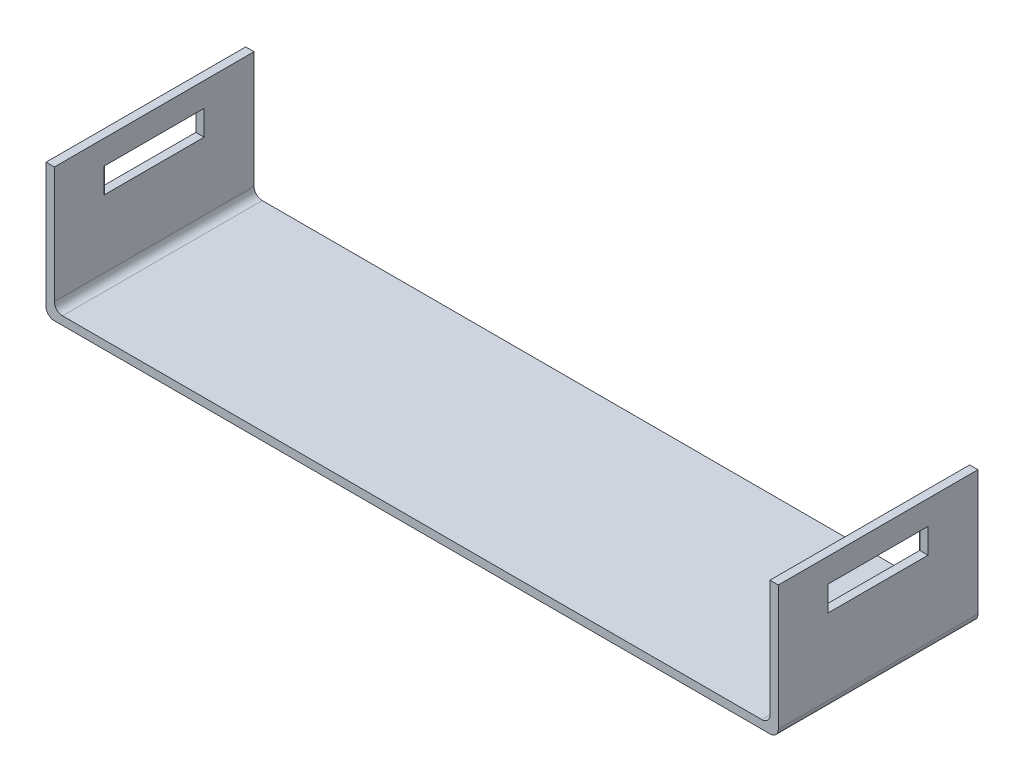
ISO-10303-21;
HEADER;
FILE_DESCRIPTION(('STEP AP214'),'2;1');
FILE_NAME('part.step','',(''),(''),'','','');
FILE_SCHEMA(('AUTOMOTIVE_DESIGN { 1 0 10303 214 1 1 1 1 }'));
ENDSEC;
DATA;
#1=APPLICATION_CONTEXT('core data for automotive mechanical design processes');
#2=APPLICATION_PROTOCOL_DEFINITION('international standard','automotive_design',2000,#1);
#3=PRODUCT_CONTEXT('',#1,'mechanical');
#4=PRODUCT('Part','Part','',(#3));
#5=PRODUCT_RELATED_PRODUCT_CATEGORY('part','',(#4));
#6=PRODUCT_DEFINITION_FORMATION('','',#4);
#7=PRODUCT_DEFINITION_CONTEXT('part definition',#1,'design');
#8=PRODUCT_DEFINITION('design','',#6,#7);
#9=PRODUCT_DEFINITION_SHAPE('','',#8);
#10=(LENGTH_UNIT() NAMED_UNIT(*) SI_UNIT(.MILLI.,.METRE.));
#11=(NAMED_UNIT(*) PLANE_ANGLE_UNIT() SI_UNIT($,.RADIAN.));
#12=(NAMED_UNIT(*) SI_UNIT($,.STERADIAN.) SOLID_ANGLE_UNIT());
#13=UNCERTAINTY_MEASURE_WITH_UNIT(LENGTH_MEASURE(1.E-05),#10,'distance_accuracy_value','');
#14=(GEOMETRIC_REPRESENTATION_CONTEXT(3) GLOBAL_UNCERTAINTY_ASSIGNED_CONTEXT((#13)) GLOBAL_UNIT_ASSIGNED_CONTEXT((#10,
#11,#12)) REPRESENTATION_CONTEXT('',''));
#15=CARTESIAN_POINT('',(0.,0.,0.));
#16=DIRECTION('',(0.,0.,1.));
#17=DIRECTION('',(1.,0.,0.));
#18=AXIS2_PLACEMENT_3D('',#15,#16,#17);
#19=CARTESIAN_POINT('',(-22.,7.5,12.));
#20=DIRECTION('',(0.,-1.,0.));
#21=DIRECTION('',(1.,0.,0.));
#22=AXIS2_PLACEMENT_3D('',#19,#20,#21);
#23=PLANE('',#22);
#24=DIRECTION('',(-1.,0.,0.));
#25=VECTOR('',#24,1.);
#26=CARTESIAN_POINT('',(-22.,7.5,0.));
#27=LINE('',#26,#25);
#28=CARTESIAN_POINT('',(-21.5,7.5,0.));
#29=VERTEX_POINT('',#28);
#30=CARTESIAN_POINT('',(-22.,7.5,0.));
#31=VERTEX_POINT('',#30);
#32=EDGE_CURVE('E228',#29,#31,#27,.T.);
#33=ORIENTED_EDGE('',*,*,#32,.T.);
#34=DIRECTION('',(0.,0.,-1.));
#35=VECTOR('',#34,1.);
#36=CARTESIAN_POINT('',(-22.,7.5,12.));
#37=LINE('',#36,#35);
#38=CARTESIAN_POINT('',(-22.,7.5,12.));
#39=VERTEX_POINT('',#38);
#40=EDGE_CURVE('E312',#39,#31,#37,.T.);
#41=ORIENTED_EDGE('',*,*,#40,.F.);
#42=DIRECTION('',(-1.,0.,0.));
#43=VECTOR('',#42,1.);
#44=CARTESIAN_POINT('',(-22.,7.5,12.));
#45=LINE('',#44,#43);
#46=CARTESIAN_POINT('',(-21.5,7.5,12.));
#47=VERTEX_POINT('',#46);
#48=EDGE_CURVE('E229',#47,#39,#45,.T.);
#49=ORIENTED_EDGE('',*,*,#48,.F.);
#50=DIRECTION('',(0.,0.,-1.));
#51=VECTOR('',#50,1.);
#52=CARTESIAN_POINT('',(-21.5,7.5,12.));
#53=LINE('',#52,#51);
#54=EDGE_CURVE('E255',#47,#29,#53,.T.);
#55=ORIENTED_EDGE('',*,*,#54,.T.);
#56=EDGE_LOOP('',(#33,#41,#49,#55));
#57=FACE_BOUND('',#56,.T.);
#58=ADVANCED_FACE('F35',(#57),#23,.F.);
#59=CARTESIAN_POINT('',(-22.,-0.0100000000000054,12.));
#60=DIRECTION('',(1.,0.,0.));
#61=DIRECTION('',(0.,0.,-1.));
#62=AXIS2_PLACEMENT_3D('',#59,#60,#61);
#63=PLANE('',#62);
#64=DIRECTION('',(0.,0.,-1.));
#65=VECTOR('',#64,1.);
#66=CARTESIAN_POINT('',(-22.,6.05,3.));
#67=LINE('',#66,#65);
#68=CARTESIAN_POINT('',(-22.,6.05,9.));
#69=VERTEX_POINT('',#68);
#70=CARTESIAN_POINT('',(-22.,6.05,3.));
#71=VERTEX_POINT('',#70);
#72=EDGE_CURVE('E206',#69,#71,#67,.T.);
#73=ORIENTED_EDGE('',*,*,#72,.F.);
#74=DIRECTION('',(0.,1.,0.));
#75=VECTOR('',#74,1.);
#76=CARTESIAN_POINT('',(-22.,6.05,9.));
#77=LINE('',#76,#75);
#78=CARTESIAN_POINT('',(-22.,4.55,9.));
#79=VERTEX_POINT('',#78);
#80=EDGE_CURVE('E49',#79,#69,#77,.T.);
#81=ORIENTED_EDGE('',*,*,#80,.F.);
#82=DIRECTION('',(0.,0.,1.));
#83=VECTOR('',#82,1.);
#84=CARTESIAN_POINT('',(-22.,4.55,3.));
#85=LINE('',#84,#83);
#86=CARTESIAN_POINT('',(-22.,4.55,3.));
#87=VERTEX_POINT('',#86);
#88=EDGE_CURVE('E197',#87,#79,#85,.T.);
#89=ORIENTED_EDGE('',*,*,#88,.F.);
#90=DIRECTION('',(0.,-1.,0.));
#91=VECTOR('',#90,1.);
#92=CARTESIAN_POINT('',(-22.,6.05,3.));
#93=LINE('',#92,#91);
#94=EDGE_CURVE('E200',#71,#87,#93,.T.);
#95=ORIENTED_EDGE('',*,*,#94,.F.);
#96=EDGE_LOOP('',(#73,#81,#89,#95));
#97=FACE_BOUND('',#96,.T.);
#98=DIRECTION('',(0.,-1.,0.));
#99=VECTOR('',#98,1.);
#100=CARTESIAN_POINT('',(-22.,-0.0100000000000054,0.));
#101=LINE('',#100,#99);
#102=CARTESIAN_POINT('',(-22.,-0.0100000000000054,0.));
#103=VERTEX_POINT('',#102);
#104=EDGE_CURVE('E258',#31,#103,#101,.T.);
#105=ORIENTED_EDGE('',*,*,#104,.T.);
#106=DIRECTION('',(0.,0.,-1.));
#107=VECTOR('',#106,1.);
#108=CARTESIAN_POINT('',(-22.,-0.0100000000000054,12.));
#109=LINE('',#108,#107);
#110=CARTESIAN_POINT('',(-22.,-0.0100000000000054,12.));
#111=VERTEX_POINT('',#110);
#112=EDGE_CURVE('E309',#111,#103,#109,.T.);
#113=ORIENTED_EDGE('',*,*,#112,.F.);
#114=DIRECTION('',(0.,-1.,0.));
#115=VECTOR('',#114,1.);
#116=CARTESIAN_POINT('',(-22.,-0.0100000000000054,12.));
#117=LINE('',#116,#115);
#118=EDGE_CURVE('E232',#39,#111,#117,.T.);
#119=ORIENTED_EDGE('',*,*,#118,.F.);
#120=ORIENTED_EDGE('',*,*,#40,.T.);
#121=EDGE_LOOP('',(#105,#113,#119,#120));
#122=FACE_BOUND('',#121,.T.);
#123=ADVANCED_FACE('F335',(#97,#122),#63,.F.);
#124=CARTESIAN_POINT('',(-21.51,-0.0100000000000054,12.));
#125=DIRECTION('',(0.,0.,-1.));
#126=DIRECTION('',(-1.,0.,0.));
#127=AXIS2_PLACEMENT_3D('',#124,#125,#126);
#128=CYLINDRICAL_SURFACE('',#127,0.49);
#129=CARTESIAN_POINT('',(-21.51,-0.0100000000000054,0.));
#130=DIRECTION('',(0.,0.,1.));
#131=DIRECTION('',(-1.,0.,0.));
#132=AXIS2_PLACEMENT_3D('',#129,#130,#131);
#133=CIRCLE('',#132,0.49);
#134=CARTESIAN_POINT('',(-21.51,-0.500000000000006,0.));
#135=VERTEX_POINT('',#134);
#136=EDGE_CURVE('E260',#103,#135,#133,.T.);
#137=ORIENTED_EDGE('',*,*,#136,.T.);
#138=DIRECTION('',(0.,0.,-1.));
#139=VECTOR('',#138,1.);
#140=CARTESIAN_POINT('',(-21.51,-0.500000000000006,12.));
#141=LINE('',#140,#139);
#142=CARTESIAN_POINT('',(-21.51,-0.500000000000006,12.));
#143=VERTEX_POINT('',#142);
#144=EDGE_CURVE('E306',#143,#135,#141,.T.);
#145=ORIENTED_EDGE('',*,*,#144,.F.);
#146=CARTESIAN_POINT('',(-21.51,-0.0100000000000054,12.));
#147=DIRECTION('',(0.,0.,1.));
#148=DIRECTION('',(-1.,0.,0.));
#149=AXIS2_PLACEMENT_3D('',#146,#147,#148);
#150=CIRCLE('',#149,0.49);
#151=EDGE_CURVE('E235',#111,#143,#150,.T.);
#152=ORIENTED_EDGE('',*,*,#151,.F.);
#153=ORIENTED_EDGE('',*,*,#112,.T.);
#154=EDGE_LOOP('',(#137,#145,#152,#153));
#155=FACE_BOUND('',#154,.T.);
#156=ADVANCED_FACE('F355',(#155),#128,.T.);
#157=CARTESIAN_POINT('',(21.51,-0.5,12.));
#158=DIRECTION('',(0.,1.,0.));
#159=DIRECTION('',(-1.,0.,0.));
#160=AXIS2_PLACEMENT_3D('',#157,#158,#159);
#161=PLANE('',#160);
#162=DIRECTION('',(1.,0.,0.));
#163=VECTOR('',#162,1.);
#164=CARTESIAN_POINT('',(21.51,-0.5,0.));
#165=LINE('',#164,#163);
#166=CARTESIAN_POINT('',(21.51,-0.5,0.));
#167=VERTEX_POINT('',#166);
#168=EDGE_CURVE('E262',#135,#167,#165,.T.);
#169=ORIENTED_EDGE('',*,*,#168,.T.);
#170=DIRECTION('',(0.,0.,-1.));
#171=VECTOR('',#170,1.);
#172=CARTESIAN_POINT('',(21.51,-0.5,12.));
#173=LINE('',#172,#171);
#174=CARTESIAN_POINT('',(21.51,-0.5,12.));
#175=VERTEX_POINT('',#174);
#176=EDGE_CURVE('E303',#175,#167,#173,.T.);
#177=ORIENTED_EDGE('',*,*,#176,.F.);
#178=DIRECTION('',(1.,0.,0.));
#179=VECTOR('',#178,1.);
#180=CARTESIAN_POINT('',(21.51,-0.5,12.));
#181=LINE('',#180,#179);
#182=EDGE_CURVE('E237',#143,#175,#181,.T.);
#183=ORIENTED_EDGE('',*,*,#182,.F.);
#184=ORIENTED_EDGE('',*,*,#144,.T.);
#185=EDGE_LOOP('',(#169,#177,#183,#184));
#186=FACE_BOUND('',#185,.T.);
#187=ADVANCED_FACE('F404',(#186),#161,.F.);
#188=CARTESIAN_POINT('',(21.51,-0.00999999999999959,12.));
#189=DIRECTION('',(0.,0.,-1.));
#190=DIRECTION('',(-1.,0.,0.));
#191=AXIS2_PLACEMENT_3D('',#188,#189,#190);
#192=CYLINDRICAL_SURFACE('',#191,0.490000000000001);
#193=CARTESIAN_POINT('',(21.51,-0.00999999999999959,0.));
#194=DIRECTION('',(0.,0.,1.));
#195=DIRECTION('',(-1.,0.,0.));
#196=AXIS2_PLACEMENT_3D('',#193,#194,#195);
#197=CIRCLE('',#196,0.490000000000001);
#198=CARTESIAN_POINT('',(22.,-0.00999999999999953,0.));
#199=VERTEX_POINT('',#198);
#200=EDGE_CURVE('E264',#167,#199,#197,.T.);
#201=ORIENTED_EDGE('',*,*,#200,.T.);
#202=DIRECTION('',(0.,0.,-1.));
#203=VECTOR('',#202,1.);
#204=CARTESIAN_POINT('',(22.,-0.00999999999999953,12.));
#205=LINE('',#204,#203);
#206=CARTESIAN_POINT('',(22.,-0.00999999999999953,12.));
#207=VERTEX_POINT('',#206);
#208=EDGE_CURVE('E300',#207,#199,#205,.T.);
#209=ORIENTED_EDGE('',*,*,#208,.F.);
#210=CARTESIAN_POINT('',(21.51,-0.00999999999999959,12.));
#211=DIRECTION('',(0.,0.,1.));
#212=DIRECTION('',(-1.,0.,0.));
#213=AXIS2_PLACEMENT_3D('',#210,#211,#212);
#214=CIRCLE('',#213,0.490000000000001);
#215=EDGE_CURVE('E239',#175,#207,#214,.T.);
#216=ORIENTED_EDGE('',*,*,#215,.F.);
#217=ORIENTED_EDGE('',*,*,#176,.T.);
#218=EDGE_LOOP('',(#201,#209,#216,#217));
#219=FACE_BOUND('',#218,.T.);
#220=ADVANCED_FACE('F401',(#219),#192,.T.);
#221=CARTESIAN_POINT('',(22.,7.5,12.));
#222=DIRECTION('',(-1.,0.,0.));
#223=DIRECTION('',(0.,0.,1.));
#224=AXIS2_PLACEMENT_3D('',#221,#222,#223);
#225=PLANE('',#224);
#226=DIRECTION('',(0.,0.,1.));
#227=VECTOR('',#226,1.);
#228=CARTESIAN_POINT('',(22.,4.55,3.));
#229=LINE('',#228,#227);
#230=CARTESIAN_POINT('',(22.,4.55,3.));
#231=VERTEX_POINT('',#230);
#232=CARTESIAN_POINT('',(22.,4.55,9.));
#233=VERTEX_POINT('',#232);
#234=EDGE_CURVE('E196',#231,#233,#229,.T.);
#235=ORIENTED_EDGE('',*,*,#234,.T.);
#236=DIRECTION('',(0.,1.,0.));
#237=VECTOR('',#236,1.);
#238=CARTESIAN_POINT('',(22.,6.05,9.));
#239=LINE('',#238,#237);
#240=CARTESIAN_POINT('',(22.,6.05,9.));
#241=VERTEX_POINT('',#240);
#242=EDGE_CURVE('E178',#233,#241,#239,.T.);
#243=ORIENTED_EDGE('',*,*,#242,.T.);
#244=DIRECTION('',(0.,0.,-1.));
#245=VECTOR('',#244,1.);
#246=CARTESIAN_POINT('',(22.,6.05,3.));
#247=LINE('',#246,#245);
#248=CARTESIAN_POINT('',(22.,6.05,3.));
#249=VERTEX_POINT('',#248);
#250=EDGE_CURVE('E188',#241,#249,#247,.T.);
#251=ORIENTED_EDGE('',*,*,#250,.T.);
#252=DIRECTION('',(0.,-1.,0.));
#253=VECTOR('',#252,1.);
#254=CARTESIAN_POINT('',(22.,6.05,3.));
#255=LINE('',#254,#253);
#256=EDGE_CURVE('E57',#249,#231,#255,.T.);
#257=ORIENTED_EDGE('',*,*,#256,.T.);
#258=EDGE_LOOP('',(#235,#243,#251,#257));
#259=FACE_BOUND('',#258,.T.);
#260=DIRECTION('',(0.,1.,0.));
#261=VECTOR('',#260,1.);
#262=CARTESIAN_POINT('',(22.,7.5,0.));
#263=LINE('',#262,#261);
#264=CARTESIAN_POINT('',(22.,7.5,0.));
#265=VERTEX_POINT('',#264);
#266=EDGE_CURVE('E266',#199,#265,#263,.T.);
#267=ORIENTED_EDGE('',*,*,#266,.T.);
#268=DIRECTION('',(0.,0.,-1.));
#269=VECTOR('',#268,1.);
#270=CARTESIAN_POINT('',(22.,7.5,12.));
#271=LINE('',#270,#269);
#272=CARTESIAN_POINT('',(22.,7.5,12.));
#273=VERTEX_POINT('',#272);
#274=EDGE_CURVE('E297',#273,#265,#271,.T.);
#275=ORIENTED_EDGE('',*,*,#274,.F.);
#276=DIRECTION('',(0.,1.,0.));
#277=VECTOR('',#276,1.);
#278=CARTESIAN_POINT('',(22.,7.5,12.));
#279=LINE('',#278,#277);
#280=EDGE_CURVE('E241',#207,#273,#279,.T.);
#281=ORIENTED_EDGE('',*,*,#280,.F.);
#282=ORIENTED_EDGE('',*,*,#208,.T.);
#283=EDGE_LOOP('',(#267,#275,#281,#282));
#284=FACE_BOUND('',#283,.T.);
#285=ADVANCED_FACE('F193',(#259,#284),#225,.F.);
#286=CARTESIAN_POINT('',(21.5,7.5,12.));
#287=DIRECTION('',(0.,-1.,0.));
#288=DIRECTION('',(0.,0.,-1.));
#289=AXIS2_PLACEMENT_3D('',#286,#287,#288);
#290=PLANE('',#289);
#291=DIRECTION('',(-1.,0.,0.));
#292=VECTOR('',#291,1.);
#293=CARTESIAN_POINT('',(21.5,7.5,0.));
#294=LINE('',#293,#292);
#295=CARTESIAN_POINT('',(21.5,7.5,0.));
#296=VERTEX_POINT('',#295);
#297=EDGE_CURVE('E268',#265,#296,#294,.T.);
#298=ORIENTED_EDGE('',*,*,#297,.T.);
#299=DIRECTION('',(0.,0.,-1.));
#300=VECTOR('',#299,1.);
#301=CARTESIAN_POINT('',(21.5,7.5,12.));
#302=LINE('',#301,#300);
#303=CARTESIAN_POINT('',(21.5,7.5,12.));
#304=VERTEX_POINT('',#303);
#305=EDGE_CURVE('E294',#304,#296,#302,.T.);
#306=ORIENTED_EDGE('',*,*,#305,.F.);
#307=DIRECTION('',(-1.,0.,0.));
#308=VECTOR('',#307,1.);
#309=CARTESIAN_POINT('',(21.5,7.5,12.));
#310=LINE('',#309,#308);
#311=EDGE_CURVE('E243',#273,#304,#310,.T.);
#312=ORIENTED_EDGE('',*,*,#311,.F.);
#313=ORIENTED_EDGE('',*,*,#274,.T.);
#314=EDGE_LOOP('',(#298,#306,#312,#313));
#315=FACE_BOUND('',#314,.T.);
#316=ADVANCED_FACE('F395',(#315),#290,.F.);
#317=CARTESIAN_POINT('',(21.5,0.49,12.));
#318=DIRECTION('',(1.,0.,0.));
#319=DIRECTION('',(0.,1.,0.));
#320=AXIS2_PLACEMENT_3D('',#317,#318,#319);
#321=PLANE('',#320);
#322=DIRECTION('',(0.,0.,1.));
#323=VECTOR('',#322,1.);
#324=CARTESIAN_POINT('',(21.5,6.05,12.));
#325=LINE('',#324,#323);
#326=CARTESIAN_POINT('',(21.5,6.05,3.));
#327=VERTEX_POINT('',#326);
#328=CARTESIAN_POINT('',(21.5,6.05,9.));
#329=VERTEX_POINT('',#328);
#330=EDGE_CURVE('E213',#327,#329,#325,.T.);
#331=ORIENTED_EDGE('',*,*,#330,.T.);
#332=DIRECTION('',(0.,-1.,0.));
#333=VECTOR('',#332,1.);
#334=CARTESIAN_POINT('',(21.5,0.49,9.));
#335=LINE('',#334,#333);
#336=CARTESIAN_POINT('',(21.5,4.55,9.));
#337=VERTEX_POINT('',#336);
#338=EDGE_CURVE('E181',#329,#337,#335,.T.);
#339=ORIENTED_EDGE('',*,*,#338,.T.);
#340=DIRECTION('',(0.,0.,-1.));
#341=VECTOR('',#340,1.);
#342=CARTESIAN_POINT('',(21.5,4.55,12.));
#343=LINE('',#342,#341);
#344=CARTESIAN_POINT('',(21.5,4.55,3.));
#345=VERTEX_POINT('',#344);
#346=EDGE_CURVE('E224',#337,#345,#343,.T.);
#347=ORIENTED_EDGE('',*,*,#346,.T.);
#348=DIRECTION('',(0.,1.,0.));
#349=VECTOR('',#348,1.);
#350=CARTESIAN_POINT('',(21.5,0.490000000000003,3.));
#351=LINE('',#350,#349);
#352=EDGE_CURVE('E221',#345,#327,#351,.T.);
#353=ORIENTED_EDGE('',*,*,#352,.T.);
#354=EDGE_LOOP('',(#331,#339,#347,#353));
#355=FACE_BOUND('',#354,.T.);
#356=DIRECTION('',(0.,-1.,0.));
#357=VECTOR('',#356,1.);
#358=CARTESIAN_POINT('',(21.5,0.49,0.));
#359=LINE('',#358,#357);
#360=CARTESIAN_POINT('',(21.5,0.49,0.));
#361=VERTEX_POINT('',#360);
#362=EDGE_CURVE('E270',#296,#361,#359,.T.);
#363=ORIENTED_EDGE('',*,*,#362,.T.);
#364=DIRECTION('',(0.,0.,-1.));
#365=VECTOR('',#364,1.);
#366=CARTESIAN_POINT('',(21.5,0.49,12.));
#367=LINE('',#366,#365);
#368=CARTESIAN_POINT('',(21.5,0.49,12.));
#369=VERTEX_POINT('',#368);
#370=EDGE_CURVE('E291',#369,#361,#367,.T.);
#371=ORIENTED_EDGE('',*,*,#370,.F.);
#372=DIRECTION('',(0.,-1.,0.));
#373=VECTOR('',#372,1.);
#374=CARTESIAN_POINT('',(21.5,0.49,12.));
#375=LINE('',#374,#373);
#376=EDGE_CURVE('E245',#304,#369,#375,.T.);
#377=ORIENTED_EDGE('',*,*,#376,.F.);
#378=ORIENTED_EDGE('',*,*,#305,.T.);
#379=EDGE_LOOP('',(#363,#371,#377,#378));
#380=FACE_BOUND('',#379,.T.);
#381=ADVANCED_FACE('F390',(#355,#380),#321,.F.);
#382=CARTESIAN_POINT('',(21.01,0.49,12.));
#383=DIRECTION('',(0.,0.,-1.));
#384=DIRECTION('',(-1.,0.,0.));
#385=AXIS2_PLACEMENT_3D('',#382,#383,#384);
#386=CYLINDRICAL_SURFACE('',#385,0.489999999999999);
#387=CARTESIAN_POINT('',(21.01,0.49,0.));
#388=DIRECTION('',(0.,0.,-1.));
#389=DIRECTION('',(1.,0.,0.));
#390=AXIS2_PLACEMENT_3D('',#387,#388,#389);
#391=CIRCLE('',#390,0.489999999999999);
#392=CARTESIAN_POINT('',(21.01,0.,0.));
#393=VERTEX_POINT('',#392);
#394=EDGE_CURVE('E272',#361,#393,#391,.T.);
#395=ORIENTED_EDGE('',*,*,#394,.T.);
#396=DIRECTION('',(0.,0.,-1.));
#397=VECTOR('',#396,1.);
#398=CARTESIAN_POINT('',(21.01,0.,12.));
#399=LINE('',#398,#397);
#400=CARTESIAN_POINT('',(21.01,0.,12.));
#401=VERTEX_POINT('',#400);
#402=EDGE_CURVE('E288',#401,#393,#399,.T.);
#403=ORIENTED_EDGE('',*,*,#402,.F.);
#404=CARTESIAN_POINT('',(21.01,0.49,12.));
#405=DIRECTION('',(0.,0.,-1.));
#406=DIRECTION('',(1.,0.,0.));
#407=AXIS2_PLACEMENT_3D('',#404,#405,#406);
#408=CIRCLE('',#407,0.489999999999999);
#409=EDGE_CURVE('E247',#369,#401,#408,.T.);
#410=ORIENTED_EDGE('',*,*,#409,.F.);
#411=ORIENTED_EDGE('',*,*,#370,.T.);
#412=EDGE_LOOP('',(#395,#403,#410,#411));
#413=FACE_BOUND('',#412,.T.);
#414=ADVANCED_FACE('F381',(#413),#386,.F.);
#415=CARTESIAN_POINT('',(-21.01,0.,12.));
#416=DIRECTION('',(0.,-1.,0.));
#417=DIRECTION('',(0.,0.,-1.));
#418=AXIS2_PLACEMENT_3D('',#415,#416,#417);
#419=PLANE('',#418);
#420=DIRECTION('',(-1.,0.,0.));
#421=VECTOR('',#420,1.);
#422=CARTESIAN_POINT('',(-21.01,0.,0.));
#423=LINE('',#422,#421);
#424=CARTESIAN_POINT('',(-21.01,0.,0.));
#425=VERTEX_POINT('',#424);
#426=EDGE_CURVE('E275',#393,#425,#423,.T.);
#427=ORIENTED_EDGE('',*,*,#426,.T.);
#428=DIRECTION('',(0.,0.,-1.));
#429=VECTOR('',#428,1.);
#430=CARTESIAN_POINT('',(-21.01,0.,12.));
#431=LINE('',#430,#429);
#432=CARTESIAN_POINT('',(-21.01,0.,12.));
#433=VERTEX_POINT('',#432);
#434=EDGE_CURVE('E285',#433,#425,#431,.T.);
#435=ORIENTED_EDGE('',*,*,#434,.F.);
#436=DIRECTION('',(-1.,0.,0.));
#437=VECTOR('',#436,1.);
#438=CARTESIAN_POINT('',(0.,0.,12.));
#439=LINE('',#438,#437);
#440=EDGE_CURVE('E249',#401,#433,#439,.T.);
#441=ORIENTED_EDGE('',*,*,#440,.F.);
#442=ORIENTED_EDGE('',*,*,#402,.T.);
#443=EDGE_LOOP('',(#427,#435,#441,#442));
#444=FACE_BOUND('',#443,.T.);
#445=ADVANCED_FACE('F385',(#444),#419,.F.);
#446=CARTESIAN_POINT('',(-21.01,0.49,12.));
#447=DIRECTION('',(0.,0.,-1.));
#448=DIRECTION('',(-1.,0.,0.));
#449=AXIS2_PLACEMENT_3D('',#446,#447,#448);
#450=CYLINDRICAL_SURFACE('',#449,0.489999999999999);
#451=CARTESIAN_POINT('',(-21.01,0.49,0.));
#452=DIRECTION('',(0.,0.,-1.));
#453=DIRECTION('',(1.,0.,0.));
#454=AXIS2_PLACEMENT_3D('',#451,#452,#453);
#455=CIRCLE('',#454,0.489999999999999);
#456=CARTESIAN_POINT('',(-21.5,0.49,0.));
#457=VERTEX_POINT('',#456);
#458=EDGE_CURVE('E277',#425,#457,#455,.T.);
#459=ORIENTED_EDGE('',*,*,#458,.T.);
#460=DIRECTION('',(0.,0.,-1.));
#461=VECTOR('',#460,1.);
#462=CARTESIAN_POINT('',(-21.5,0.49,12.));
#463=LINE('',#462,#461);
#464=CARTESIAN_POINT('',(-21.5,0.49,12.));
#465=VERTEX_POINT('',#464);
#466=EDGE_CURVE('E282',#465,#457,#463,.T.);
#467=ORIENTED_EDGE('',*,*,#466,.F.);
#468=CARTESIAN_POINT('',(-21.01,0.49,12.));
#469=DIRECTION('',(0.,0.,-1.));
#470=DIRECTION('',(1.,0.,0.));
#471=AXIS2_PLACEMENT_3D('',#468,#469,#470);
#472=CIRCLE('',#471,0.489999999999999);
#473=EDGE_CURVE('E251',#433,#465,#472,.T.);
#474=ORIENTED_EDGE('',*,*,#473,.F.);
#475=ORIENTED_EDGE('',*,*,#434,.T.);
#476=EDGE_LOOP('',(#459,#467,#474,#475));
#477=FACE_BOUND('',#476,.T.);
#478=ADVANCED_FACE('F374',(#477),#450,.F.);
#479=CARTESIAN_POINT('',(-21.5,7.5,12.));
#480=DIRECTION('',(-1.,0.,0.));
#481=DIRECTION('',(0.,0.,1.));
#482=AXIS2_PLACEMENT_3D('',#479,#480,#481);
#483=PLANE('',#482);
#484=DIRECTION('',(0.,0.,1.));
#485=VECTOR('',#484,1.);
#486=CARTESIAN_POINT('',(-21.5,4.55,12.));
#487=LINE('',#486,#485);
#488=CARTESIAN_POINT('',(-21.5,4.55,3.));
#489=VERTEX_POINT('',#488);
#490=CARTESIAN_POINT('',(-21.5,4.55,9.));
#491=VERTEX_POINT('',#490);
#492=EDGE_CURVE('E42',#489,#491,#487,.T.);
#493=ORIENTED_EDGE('',*,*,#492,.T.);
#494=DIRECTION('',(0.,1.,0.));
#495=VECTOR('',#494,1.);
#496=CARTESIAN_POINT('',(-21.5,7.5,9.));
#497=LINE('',#496,#495);
#498=CARTESIAN_POINT('',(-21.5,6.05,9.));
#499=VERTEX_POINT('',#498);
#500=EDGE_CURVE('E11',#491,#499,#497,.T.);
#501=ORIENTED_EDGE('',*,*,#500,.T.);
#502=DIRECTION('',(0.,0.,-1.));
#503=VECTOR('',#502,1.);
#504=CARTESIAN_POINT('',(-21.5,6.05,12.));
#505=LINE('',#504,#503);
#506=CARTESIAN_POINT('',(-21.5,6.05,3.));
#507=VERTEX_POINT('',#506);
#508=EDGE_CURVE('E315',#499,#507,#505,.T.);
#509=ORIENTED_EDGE('',*,*,#508,.T.);
#510=DIRECTION('',(0.,-1.,0.));
#511=VECTOR('',#510,1.);
#512=CARTESIAN_POINT('',(-21.5,7.5,3.));
#513=LINE('',#512,#511);
#514=EDGE_CURVE('E318',#507,#489,#513,.T.);
#515=ORIENTED_EDGE('',*,*,#514,.T.);
#516=EDGE_LOOP('',(#493,#501,#509,#515));
#517=FACE_BOUND('',#516,.T.);
#518=DIRECTION('',(0.,1.,0.));
#519=VECTOR('',#518,1.);
#520=CARTESIAN_POINT('',(-21.5,7.5,0.));
#521=LINE('',#520,#519);
#522=EDGE_CURVE('E233',#457,#29,#521,.T.);
#523=ORIENTED_EDGE('',*,*,#522,.T.);
#524=ORIENTED_EDGE('',*,*,#54,.F.);
#525=DIRECTION('',(0.,1.,0.));
#526=VECTOR('',#525,1.);
#527=CARTESIAN_POINT('',(-21.5,7.5,12.));
#528=LINE('',#527,#526);
#529=EDGE_CURVE('E253',#465,#47,#528,.T.);
#530=ORIENTED_EDGE('',*,*,#529,.F.);
#531=ORIENTED_EDGE('',*,*,#466,.T.);
#532=EDGE_LOOP('',(#523,#524,#530,#531));
#533=FACE_BOUND('',#532,.T.);
#534=ADVANCED_FACE('F322',(#517,#533),#483,.F.);
#535=CARTESIAN_POINT('',(-21.01,0.49,12.));
#536=DIRECTION('',(0.,0.,1.));
#537=DIRECTION('',(1.,0.,0.));
#538=AXIS2_PLACEMENT_3D('',#535,#536,#537);
#539=PLANE('',#538);
#540=ORIENTED_EDGE('',*,*,#48,.T.);
#541=ORIENTED_EDGE('',*,*,#118,.T.);
#542=ORIENTED_EDGE('',*,*,#151,.T.);
#543=ORIENTED_EDGE('',*,*,#182,.T.);
#544=ORIENTED_EDGE('',*,*,#215,.T.);
#545=ORIENTED_EDGE('',*,*,#280,.T.);
#546=ORIENTED_EDGE('',*,*,#311,.T.);
#547=ORIENTED_EDGE('',*,*,#376,.T.);
#548=ORIENTED_EDGE('',*,*,#409,.T.);
#549=ORIENTED_EDGE('',*,*,#440,.T.);
#550=ORIENTED_EDGE('',*,*,#473,.T.);
#551=ORIENTED_EDGE('',*,*,#529,.T.);
#552=EDGE_LOOP('',(#540,#541,#542,#543,#544,#545,#546,#547,#548,#549,#550,#551));
#553=FACE_BOUND('',#552,.T.);
#554=ADVANCED_FACE('F369',(#553),#539,.T.);
#555=CARTESIAN_POINT('',(-21.01,0.49,0.));
#556=DIRECTION('',(0.,0.,1.));
#557=DIRECTION('',(1.,0.,0.));
#558=AXIS2_PLACEMENT_3D('',#555,#556,#557);
#559=PLANE('',#558);
#560=ORIENTED_EDGE('',*,*,#32,.F.);
#561=ORIENTED_EDGE('',*,*,#522,.F.);
#562=ORIENTED_EDGE('',*,*,#458,.F.);
#563=ORIENTED_EDGE('',*,*,#426,.F.);
#564=ORIENTED_EDGE('',*,*,#394,.F.);
#565=ORIENTED_EDGE('',*,*,#362,.F.);
#566=ORIENTED_EDGE('',*,*,#297,.F.);
#567=ORIENTED_EDGE('',*,*,#266,.F.);
#568=ORIENTED_EDGE('',*,*,#200,.F.);
#569=ORIENTED_EDGE('',*,*,#168,.F.);
#570=ORIENTED_EDGE('',*,*,#136,.F.);
#571=ORIENTED_EDGE('',*,*,#104,.F.);
#572=EDGE_LOOP('',(#560,#561,#562,#563,#564,#565,#566,#567,#568,#569,#570,#571));
#573=FACE_BOUND('',#572,.T.);
#574=ADVANCED_FACE('F362',(#573),#559,.F.);
#575=CARTESIAN_POINT('',(22.,6.05,3.));
#576=DIRECTION('',(0.,1.,0.));
#577=DIRECTION('',(0.,0.,1.));
#578=AXIS2_PLACEMENT_3D('',#575,#576,#577);
#579=PLANE('',#578);
#580=DIRECTION('',(-1.,0.,0.));
#581=VECTOR('',#580,1.);
#582=CARTESIAN_POINT('',(22.,6.05,9.));
#583=LINE('',#582,#581);
#584=EDGE_CURVE('E185',#499,#69,#583,.T.);
#585=ORIENTED_EDGE('',*,*,#584,.T.);
#586=ORIENTED_EDGE('',*,*,#72,.T.);
#587=DIRECTION('',(-1.,0.,0.));
#588=VECTOR('',#587,1.);
#589=CARTESIAN_POINT('',(22.,6.05,3.));
#590=LINE('',#589,#588);
#591=EDGE_CURVE('E184',#507,#71,#590,.T.);
#592=ORIENTED_EDGE('',*,*,#591,.F.);
#593=ORIENTED_EDGE('',*,*,#508,.F.);
#594=EDGE_LOOP('',(#585,#586,#592,#593));
#595=FACE_BOUND('',#594,.T.);
#596=ADVANCED_FACE('F338',(#595),#579,.F.);
#597=CARTESIAN_POINT('',(22.,6.05,3.));
#598=DIRECTION('',(0.,0.,-1.));
#599=DIRECTION('',(0.,1.,0.));
#600=AXIS2_PLACEMENT_3D('',#597,#598,#599);
#601=PLANE('',#600);
#602=ORIENTED_EDGE('',*,*,#591,.T.);
#603=ORIENTED_EDGE('',*,*,#94,.T.);
#604=DIRECTION('',(-1.,0.,0.));
#605=VECTOR('',#604,1.);
#606=CARTESIAN_POINT('',(22.,4.55,3.));
#607=LINE('',#606,#605);
#608=EDGE_CURVE('E218',#489,#87,#607,.T.);
#609=ORIENTED_EDGE('',*,*,#608,.F.);
#610=ORIENTED_EDGE('',*,*,#514,.F.);
#611=EDGE_LOOP('',(#602,#603,#609,#610));
#612=FACE_BOUND('',#611,.T.);
#613=ADVANCED_FACE('F330',(#612),#601,.F.);
#614=CARTESIAN_POINT('',(22.,4.55,3.));
#615=DIRECTION('',(0.,-1.,0.));
#616=DIRECTION('',(0.,0.,-1.));
#617=AXIS2_PLACEMENT_3D('',#614,#615,#616);
#618=PLANE('',#617);
#619=ORIENTED_EDGE('',*,*,#608,.T.);
#620=ORIENTED_EDGE('',*,*,#88,.T.);
#621=DIRECTION('',(-1.,0.,0.));
#622=VECTOR('',#621,1.);
#623=CARTESIAN_POINT('',(22.,4.55,9.));
#624=LINE('',#623,#622);
#625=EDGE_CURVE('E214',#491,#79,#624,.T.);
#626=ORIENTED_EDGE('',*,*,#625,.F.);
#627=ORIENTED_EDGE('',*,*,#492,.F.);
#628=EDGE_LOOP('',(#619,#620,#626,#627));
#629=FACE_BOUND('',#628,.T.);
#630=ADVANCED_FACE('F328',(#629),#618,.F.);
#631=CARTESIAN_POINT('',(22.,6.05,9.));
#632=DIRECTION('',(0.,0.,1.));
#633=DIRECTION('',(1.,0.,0.));
#634=AXIS2_PLACEMENT_3D('',#631,#632,#633);
#635=PLANE('',#634);
#636=ORIENTED_EDGE('',*,*,#625,.T.);
#637=ORIENTED_EDGE('',*,*,#80,.T.);
#638=ORIENTED_EDGE('',*,*,#584,.F.);
#639=ORIENTED_EDGE('',*,*,#500,.F.);
#640=EDGE_LOOP('',(#636,#637,#638,#639));
#641=FACE_BOUND('',#640,.T.);
#642=ADVANCED_FACE('F339',(#641),#635,.F.);
#643=EDGE_CURVE('E173',#241,#329,#583,.T.);
#644=ORIENTED_EDGE('',*,*,#643,.F.);
#645=ORIENTED_EDGE('',*,*,#242,.F.);
#646=EDGE_CURVE('E211',#233,#337,#624,.T.);
#647=ORIENTED_EDGE('',*,*,#646,.T.);
#648=ORIENTED_EDGE('',*,*,#338,.F.);
#649=EDGE_LOOP('',(#644,#645,#647,#648));
#650=FACE_BOUND('',#649,.T.);
#651=ADVANCED_FACE('F175',(#650),#635,.F.);
#652=ORIENTED_EDGE('',*,*,#646,.F.);
#653=ORIENTED_EDGE('',*,*,#234,.F.);
#654=EDGE_CURVE('E215',#231,#345,#607,.T.);
#655=ORIENTED_EDGE('',*,*,#654,.T.);
#656=ORIENTED_EDGE('',*,*,#346,.F.);
#657=EDGE_LOOP('',(#652,#653,#655,#656));
#658=FACE_BOUND('',#657,.T.);
#659=ADVANCED_FACE('F346',(#658),#618,.F.);
#660=ORIENTED_EDGE('',*,*,#654,.F.);
#661=ORIENTED_EDGE('',*,*,#256,.F.);
#662=EDGE_CURVE('E190',#249,#327,#590,.T.);
#663=ORIENTED_EDGE('',*,*,#662,.T.);
#664=ORIENTED_EDGE('',*,*,#352,.F.);
#665=EDGE_LOOP('',(#660,#661,#663,#664));
#666=FACE_BOUND('',#665,.T.);
#667=ADVANCED_FACE('F455',(#666),#601,.F.);
#668=ORIENTED_EDGE('',*,*,#662,.F.);
#669=ORIENTED_EDGE('',*,*,#250,.F.);
#670=ORIENTED_EDGE('',*,*,#643,.T.);
#671=ORIENTED_EDGE('',*,*,#330,.F.);
#672=EDGE_LOOP('',(#668,#669,#670,#671));
#673=FACE_BOUND('',#672,.T.);
#674=ADVANCED_FACE('F189',(#673),#579,.F.);
#675=CLOSED_SHELL('',(#58,#123,#156,#187,#220,#285,#316,#381,#414,#445,#478,#534,#554,#574,#596,
#613,#630,#642,#651,#659,#667,#674));
#676=MANIFOLD_SOLID_BREP('B2',#675);
#677=ADVANCED_BREP_SHAPE_REPRESENTATION('',(#18,#676),#14);
#678=SHAPE_DEFINITION_REPRESENTATION(#9,#677);
ENDSEC;
END-ISO-10303-21;
